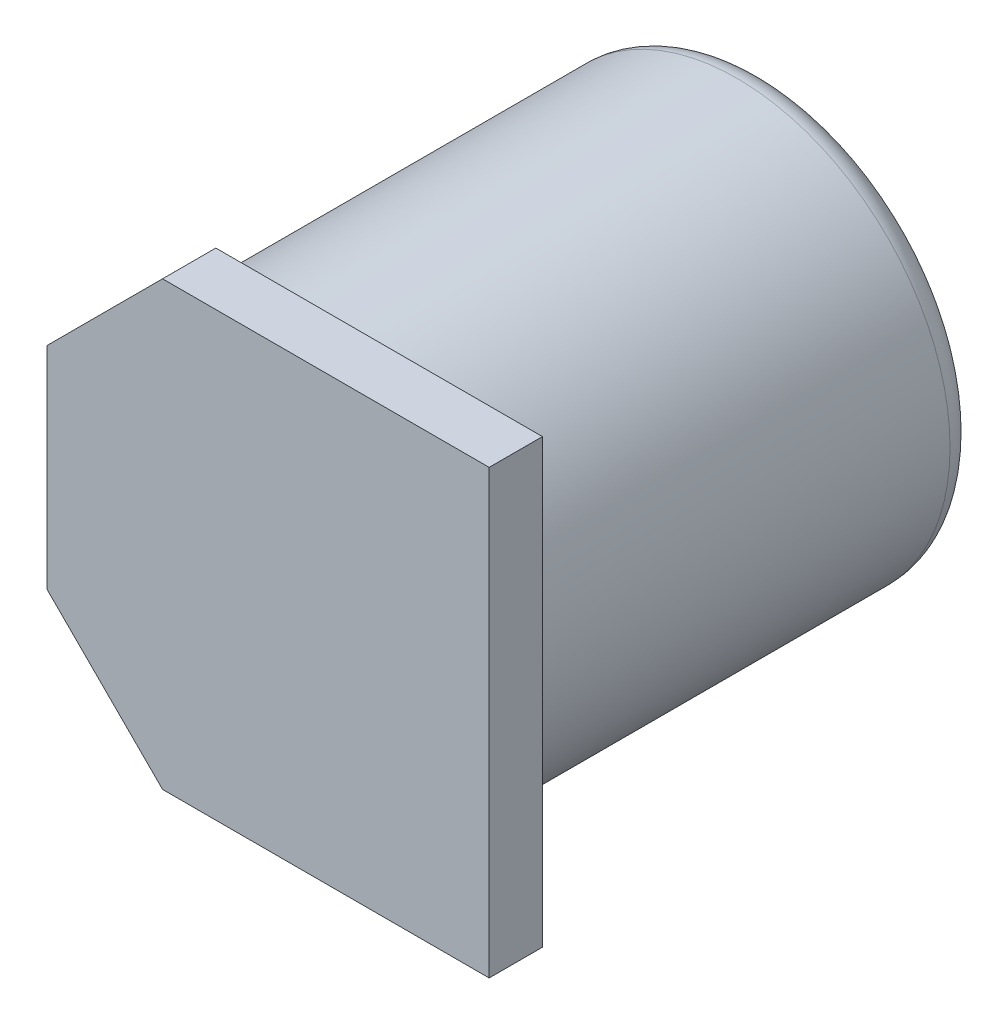
ISO-10303-21;
HEADER;
FILE_DESCRIPTION(('STEP AP214'),'2;1');
FILE_NAME('part.step','',(''),(''),'','','');
FILE_SCHEMA(('AUTOMOTIVE_DESIGN { 1 0 10303 214 1 1 1 1 }'));
ENDSEC;
DATA;
#1=APPLICATION_CONTEXT('core data for automotive mechanical design processes');
#2=APPLICATION_PROTOCOL_DEFINITION('international standard','automotive_design',2000,#1);
#3=PRODUCT_CONTEXT('',#1,'mechanical');
#4=PRODUCT('Part','Part','',(#3));
#5=PRODUCT_RELATED_PRODUCT_CATEGORY('part','',(#4));
#6=PRODUCT_DEFINITION_FORMATION('','',#4);
#7=PRODUCT_DEFINITION_CONTEXT('part definition',#1,'design');
#8=PRODUCT_DEFINITION('design','',#6,#7);
#9=PRODUCT_DEFINITION_SHAPE('','',#8);
#10=(LENGTH_UNIT() NAMED_UNIT(*) SI_UNIT(.MILLI.,.METRE.));
#11=(NAMED_UNIT(*) PLANE_ANGLE_UNIT() SI_UNIT($,.RADIAN.));
#12=(NAMED_UNIT(*) SI_UNIT($,.STERADIAN.) SOLID_ANGLE_UNIT());
#13=UNCERTAINTY_MEASURE_WITH_UNIT(LENGTH_MEASURE(1.E-05),#10,'distance_accuracy_value','');
#14=(GEOMETRIC_REPRESENTATION_CONTEXT(3) GLOBAL_UNCERTAINTY_ASSIGNED_CONTEXT((#13)) GLOBAL_UNIT_ASSIGNED_CONTEXT((#10,
#11,#12)) REPRESENTATION_CONTEXT('',''));
#15=CARTESIAN_POINT('',(0.,0.,0.));
#16=DIRECTION('',(0.,0.,1.));
#17=DIRECTION('',(1.,0.,0.));
#18=AXIS2_PLACEMENT_3D('',#15,#16,#17);
#19=CARTESIAN_POINT('',(4.15,4.15,1.));
#20=DIRECTION('',(-1.,0.,0.));
#21=DIRECTION('',(0.,0.,1.));
#22=AXIS2_PLACEMENT_3D('',#19,#20,#21);
#23=PLANE('',#22);
#24=DIRECTION('',(0.,1.,0.));
#25=VECTOR('',#24,1.);
#26=CARTESIAN_POINT('',(4.15,4.15,0.));
#27=LINE('',#26,#25);
#28=CARTESIAN_POINT('',(4.15,-4.15,0.));
#29=VERTEX_POINT('',#28);
#30=CARTESIAN_POINT('',(4.15,4.15,0.));
#31=VERTEX_POINT('',#30);
#32=EDGE_CURVE('E130',#29,#31,#27,.T.);
#33=ORIENTED_EDGE('',*,*,#32,.T.);
#34=DIRECTION('',(0.,0.,-1.));
#35=VECTOR('',#34,1.);
#36=CARTESIAN_POINT('',(4.15,4.15,1.));
#37=LINE('',#36,#35);
#38=CARTESIAN_POINT('',(4.15,4.15,1.));
#39=VERTEX_POINT('',#38);
#40=EDGE_CURVE('E158',#39,#31,#37,.T.);
#41=ORIENTED_EDGE('',*,*,#40,.F.);
#42=DIRECTION('',(0.,1.,0.));
#43=VECTOR('',#42,1.);
#44=CARTESIAN_POINT('',(4.15,4.15,1.));
#45=LINE('',#44,#43);
#46=CARTESIAN_POINT('',(4.15,-4.15,1.));
#47=VERTEX_POINT('',#46);
#48=EDGE_CURVE('E147',#47,#39,#45,.T.);
#49=ORIENTED_EDGE('',*,*,#48,.F.);
#50=DIRECTION('',(0.,0.,-1.));
#51=VECTOR('',#50,1.);
#52=CARTESIAN_POINT('',(4.15,-4.15,1.));
#53=LINE('',#52,#51);
#54=EDGE_CURVE('E126',#47,#29,#53,.T.);
#55=ORIENTED_EDGE('',*,*,#54,.T.);
#56=EDGE_LOOP('',(#33,#41,#49,#55));
#57=FACE_BOUND('',#56,.T.);
#58=ADVANCED_FACE('F39',(#57),#23,.F.);
#59=CARTESIAN_POINT('',(-1.98,4.15,1.));
#60=DIRECTION('',(0.,-1.,0.));
#61=DIRECTION('',(0.,0.,-1.));
#62=AXIS2_PLACEMENT_3D('',#59,#60,#61);
#63=PLANE('',#62);
#64=DIRECTION('',(-1.,0.,0.));
#65=VECTOR('',#64,1.);
#66=CARTESIAN_POINT('',(-1.98,4.15,0.));
#67=LINE('',#66,#65);
#68=CARTESIAN_POINT('',(-1.98,4.15,0.));
#69=VERTEX_POINT('',#68);
#70=EDGE_CURVE('E134',#31,#69,#67,.T.);
#71=ORIENTED_EDGE('',*,*,#70,.T.);
#72=DIRECTION('',(0.,0.,-1.));
#73=VECTOR('',#72,1.);
#74=CARTESIAN_POINT('',(-1.98,4.15,1.));
#75=LINE('',#74,#73);
#76=CARTESIAN_POINT('',(-1.98,4.15,1.));
#77=VERTEX_POINT('',#76);
#78=EDGE_CURVE('E154',#77,#69,#75,.T.);
#79=ORIENTED_EDGE('',*,*,#78,.F.);
#80=DIRECTION('',(-1.,0.,0.));
#81=VECTOR('',#80,1.);
#82=CARTESIAN_POINT('',(-1.98,4.15,1.));
#83=LINE('',#82,#81);
#84=EDGE_CURVE('E95',#39,#77,#83,.T.);
#85=ORIENTED_EDGE('',*,*,#84,.F.);
#86=ORIENTED_EDGE('',*,*,#40,.T.);
#87=EDGE_LOOP('',(#71,#79,#85,#86));
#88=FACE_BOUND('',#87,.T.);
#89=ADVANCED_FACE('F177',(#88),#63,.F.);
#90=CARTESIAN_POINT('',(-4.15,1.98,1.));
#91=DIRECTION('',(0.707106781186547,-0.707106781186547,0.));
#92=DIRECTION('',(0.707106781186548,0.707106781186548,0.));
#93=AXIS2_PLACEMENT_3D('',#90,#91,#92);
#94=PLANE('',#93);
#95=DIRECTION('',(-0.707106781186548,-0.707106781186548,0.));
#96=VECTOR('',#95,1.);
#97=CARTESIAN_POINT('',(-4.15,1.98,0.));
#98=LINE('',#97,#96);
#99=CARTESIAN_POINT('',(-4.15,1.98,0.));
#100=VERTEX_POINT('',#99);
#101=EDGE_CURVE('E138',#69,#100,#98,.T.);
#102=ORIENTED_EDGE('',*,*,#101,.T.);
#103=DIRECTION('',(0.,0.,-1.));
#104=VECTOR('',#103,1.);
#105=CARTESIAN_POINT('',(-4.15,1.98,1.));
#106=LINE('',#105,#104);
#107=CARTESIAN_POINT('',(-4.15,1.98,1.));
#108=VERTEX_POINT('',#107);
#109=EDGE_CURVE('E119',#108,#100,#106,.T.);
#110=ORIENTED_EDGE('',*,*,#109,.F.);
#111=DIRECTION('',(-0.707106781186548,-0.707106781186548,0.));
#112=VECTOR('',#111,1.);
#113=CARTESIAN_POINT('',(-4.15,1.98,1.));
#114=LINE('',#113,#112);
#115=EDGE_CURVE('E108',#77,#108,#114,.T.);
#116=ORIENTED_EDGE('',*,*,#115,.F.);
#117=ORIENTED_EDGE('',*,*,#78,.T.);
#118=EDGE_LOOP('',(#102,#110,#116,#117));
#119=FACE_BOUND('',#118,.T.);
#120=ADVANCED_FACE('F182',(#119),#94,.F.);
#121=CARTESIAN_POINT('',(-4.15,1.98,1.));
#122=DIRECTION('',(1.,0.,0.));
#123=DIRECTION('',(0.,1.,0.));
#124=AXIS2_PLACEMENT_3D('',#121,#122,#123);
#125=PLANE('',#124);
#126=DIRECTION('',(0.,-1.,0.));
#127=VECTOR('',#126,1.);
#128=CARTESIAN_POINT('',(-4.15,1.98,0.));
#129=LINE('',#128,#127);
#130=CARTESIAN_POINT('',(-4.15,-1.98,0.));
#131=VERTEX_POINT('',#130);
#132=EDGE_CURVE('E117',#100,#131,#129,.T.);
#133=ORIENTED_EDGE('',*,*,#132,.T.);
#134=DIRECTION('',(0.,0.,-1.));
#135=VECTOR('',#134,1.);
#136=CARTESIAN_POINT('',(-4.15,-1.98,1.));
#137=LINE('',#136,#135);
#138=CARTESIAN_POINT('',(-4.15,-1.98,1.));
#139=VERTEX_POINT('',#138);
#140=EDGE_CURVE('E114',#139,#131,#137,.T.);
#141=ORIENTED_EDGE('',*,*,#140,.F.);
#142=DIRECTION('',(0.,-1.,0.));
#143=VECTOR('',#142,1.);
#144=CARTESIAN_POINT('',(-4.15,1.98,1.));
#145=LINE('',#144,#143);
#146=EDGE_CURVE('E102',#108,#139,#145,.T.);
#147=ORIENTED_EDGE('',*,*,#146,.F.);
#148=ORIENTED_EDGE('',*,*,#109,.T.);
#149=EDGE_LOOP('',(#133,#141,#147,#148));
#150=FACE_BOUND('',#149,.T.);
#151=ADVANCED_FACE('F115',(#150),#125,.F.);
#152=CARTESIAN_POINT('',(-4.15,-1.98,1.));
#153=DIRECTION('',(0.707106781186547,0.707106781186547,0.));
#154=DIRECTION('',(-0.707106781186548,0.707106781186548,0.));
#155=AXIS2_PLACEMENT_3D('',#152,#153,#154);
#156=PLANE('',#155);
#157=DIRECTION('',(0.707106781186548,-0.707106781186548,0.));
#158=VECTOR('',#157,1.);
#159=CARTESIAN_POINT('',(-4.15,-1.98,0.));
#160=LINE('',#159,#158);
#161=CARTESIAN_POINT('',(-1.98,-4.15,0.));
#162=VERTEX_POINT('',#161);
#163=EDGE_CURVE('E80',#131,#162,#160,.T.);
#164=ORIENTED_EDGE('',*,*,#163,.T.);
#165=DIRECTION('',(0.,0.,-1.));
#166=VECTOR('',#165,1.);
#167=CARTESIAN_POINT('',(-1.98,-4.15,1.));
#168=LINE('',#167,#166);
#169=CARTESIAN_POINT('',(-1.98,-4.15,1.));
#170=VERTEX_POINT('',#169);
#171=EDGE_CURVE('E120',#170,#162,#168,.T.);
#172=ORIENTED_EDGE('',*,*,#171,.F.);
#173=DIRECTION('',(0.707106781186548,-0.707106781186548,0.));
#174=VECTOR('',#173,1.);
#175=CARTESIAN_POINT('',(-4.15,-1.98,1.));
#176=LINE('',#175,#174);
#177=EDGE_CURVE('E106',#139,#170,#176,.T.);
#178=ORIENTED_EDGE('',*,*,#177,.F.);
#179=ORIENTED_EDGE('',*,*,#140,.T.);
#180=EDGE_LOOP('',(#164,#172,#178,#179));
#181=FACE_BOUND('',#180,.T.);
#182=ADVANCED_FACE('F122',(#181),#156,.F.);
#183=CARTESIAN_POINT('',(-1.98,-4.15,1.));
#184=DIRECTION('',(0.,1.,0.));
#185=DIRECTION('',(-1.,0.,0.));
#186=AXIS2_PLACEMENT_3D('',#183,#184,#185);
#187=PLANE('',#186);
#188=DIRECTION('',(1.,0.,0.));
#189=VECTOR('',#188,1.);
#190=CARTESIAN_POINT('',(-1.98,-4.15,0.));
#191=LINE('',#190,#189);
#192=EDGE_CURVE('E86',#162,#29,#191,.T.);
#193=ORIENTED_EDGE('',*,*,#192,.T.);
#194=ORIENTED_EDGE('',*,*,#54,.F.);
#195=DIRECTION('',(1.,0.,0.));
#196=VECTOR('',#195,1.);
#197=CARTESIAN_POINT('',(-1.98,-4.15,1.));
#198=LINE('',#197,#196);
#199=EDGE_CURVE('E57',#170,#47,#198,.T.);
#200=ORIENTED_EDGE('',*,*,#199,.F.);
#201=ORIENTED_EDGE('',*,*,#171,.T.);
#202=EDGE_LOOP('',(#193,#194,#200,#201));
#203=FACE_BOUND('',#202,.T.);
#204=ADVANCED_FACE('F192',(#203),#187,.F.);
#205=CARTESIAN_POINT('',(0.,0.,1.));
#206=DIRECTION('',(0.,0.,1.));
#207=DIRECTION('',(1.,0.,0.));
#208=AXIS2_PLACEMENT_3D('',#205,#206,#207);
#209=PLANE('',#208);
#210=ORIENTED_EDGE('',*,*,#48,.T.);
#211=ORIENTED_EDGE('',*,*,#84,.T.);
#212=ORIENTED_EDGE('',*,*,#115,.T.);
#213=ORIENTED_EDGE('',*,*,#146,.T.);
#214=ORIENTED_EDGE('',*,*,#177,.T.);
#215=ORIENTED_EDGE('',*,*,#199,.T.);
#216=EDGE_LOOP('',(#210,#211,#212,#213,#214,#215));
#217=FACE_BOUND('',#216,.T.);
#218=ADVANCED_FACE('F104',(#217),#209,.T.);
#219=CARTESIAN_POINT('',(0.,0.,0.));
#220=DIRECTION('',(0.,0.,1.));
#221=DIRECTION('',(1.,0.,0.));
#222=AXIS2_PLACEMENT_3D('',#219,#220,#221);
#223=PLANE('',#222);
#224=CARTESIAN_POINT('',(0.,0.,0.));
#225=DIRECTION('',(0.,0.,1.));
#226=DIRECTION('',(1.,0.,0.));
#227=AXIS2_PLACEMENT_3D('',#224,#225,#226);
#228=CIRCLE('',#227,4.);
#229=CARTESIAN_POINT('',(4.,0.,0.));
#230=VERTEX_POINT('',#229);
#231=EDGE_CURVE('E135',#230,#230,#228,.T.);
#232=ORIENTED_EDGE('',*,*,#231,.T.);
#233=EDGE_LOOP('',(#232));
#234=FACE_BOUND('',#233,.T.);
#235=ORIENTED_EDGE('',*,*,#32,.F.);
#236=ORIENTED_EDGE('',*,*,#192,.F.);
#237=ORIENTED_EDGE('',*,*,#163,.F.);
#238=ORIENTED_EDGE('',*,*,#132,.F.);
#239=ORIENTED_EDGE('',*,*,#101,.F.);
#240=ORIENTED_EDGE('',*,*,#70,.F.);
#241=EDGE_LOOP('',(#235,#236,#237,#238,#239,#240));
#242=FACE_BOUND('',#241,.T.);
#243=ADVANCED_FACE('F195',(#234,#242),#223,.F.);
#244=CARTESIAN_POINT('',(0.,0.,-8.3));
#245=DIRECTION('',(0.,0.,1.));
#246=DIRECTION('',(1.,0.,0.));
#247=AXIS2_PLACEMENT_3D('',#244,#245,#246);
#248=CYLINDRICAL_SURFACE('',#247,4.);
#249=CARTESIAN_POINT('',(0.,0.,-7.8));
#250=DIRECTION('',(0.,0.,1.));
#251=DIRECTION('',(1.,0.,0.));
#252=AXIS2_PLACEMENT_3D('',#249,#250,#251);
#253=CIRCLE('',#252,4.);
#254=CARTESIAN_POINT('',(4.,0.,-7.8));
#255=VERTEX_POINT('',#254);
#256=EDGE_CURVE('E49',#255,#255,#253,.T.);
#257=ORIENTED_EDGE('',*,*,#256,.T.);
#258=EDGE_LOOP('',(#257));
#259=FACE_BOUND('',#258,.T.);
#260=ORIENTED_EDGE('',*,*,#231,.F.);
#261=EDGE_LOOP('',(#260));
#262=FACE_BOUND('',#261,.T.);
#263=ADVANCED_FACE('F164',(#259,#262),#248,.T.);
#264=CARTESIAN_POINT('',(0.,0.,-8.3));
#265=DIRECTION('',(0.,0.,1.));
#266=DIRECTION('',(1.,0.,0.));
#267=AXIS2_PLACEMENT_3D('',#264,#265,#266);
#268=PLANE('',#267);
#269=CARTESIAN_POINT('',(0.,0.,-8.3));
#270=DIRECTION('',(0.,0.,1.));
#271=DIRECTION('',(1.,0.,0.));
#272=AXIS2_PLACEMENT_3D('',#269,#270,#271);
#273=CIRCLE('',#272,3.5);
#274=CARTESIAN_POINT('',(3.5,0.,-8.3));
#275=VERTEX_POINT('',#274);
#276=EDGE_CURVE('E11',#275,#275,#273,.F.);
#277=ORIENTED_EDGE('',*,*,#276,.T.);
#278=EDGE_LOOP('',(#277));
#279=FACE_BOUND('',#278,.T.);
#280=ADVANCED_FACE('F168',(#279),#268,.F.);
#281=CARTESIAN_POINT('',(0.,0.,-7.8));
#282=DIRECTION('',(0.,0.,1.));
#283=DIRECTION('',(1.,0.,0.));
#284=AXIS2_PLACEMENT_3D('',#281,#282,#283);
#285=TOROIDAL_SURFACE('',#284,3.5,0.5);
#286=ORIENTED_EDGE('',*,*,#276,.F.);
#287=EDGE_LOOP('',(#286));
#288=FACE_BOUND('',#287,.T.);
#289=ORIENTED_EDGE('',*,*,#256,.F.);
#290=EDGE_LOOP('',(#289));
#291=FACE_BOUND('',#290,.T.);
#292=ADVANCED_FACE('F41',(#288,#291),#285,.T.);
#293=CLOSED_SHELL('',(#58,#89,#120,#151,#182,#204,#218,#243,#263,#280,#292));
#294=MANIFOLD_SOLID_BREP('B2',#293);
#295=ADVANCED_BREP_SHAPE_REPRESENTATION('',(#18,#294),#14);
#296=SHAPE_DEFINITION_REPRESENTATION(#9,#295);
ENDSEC;
END-ISO-10303-21;
